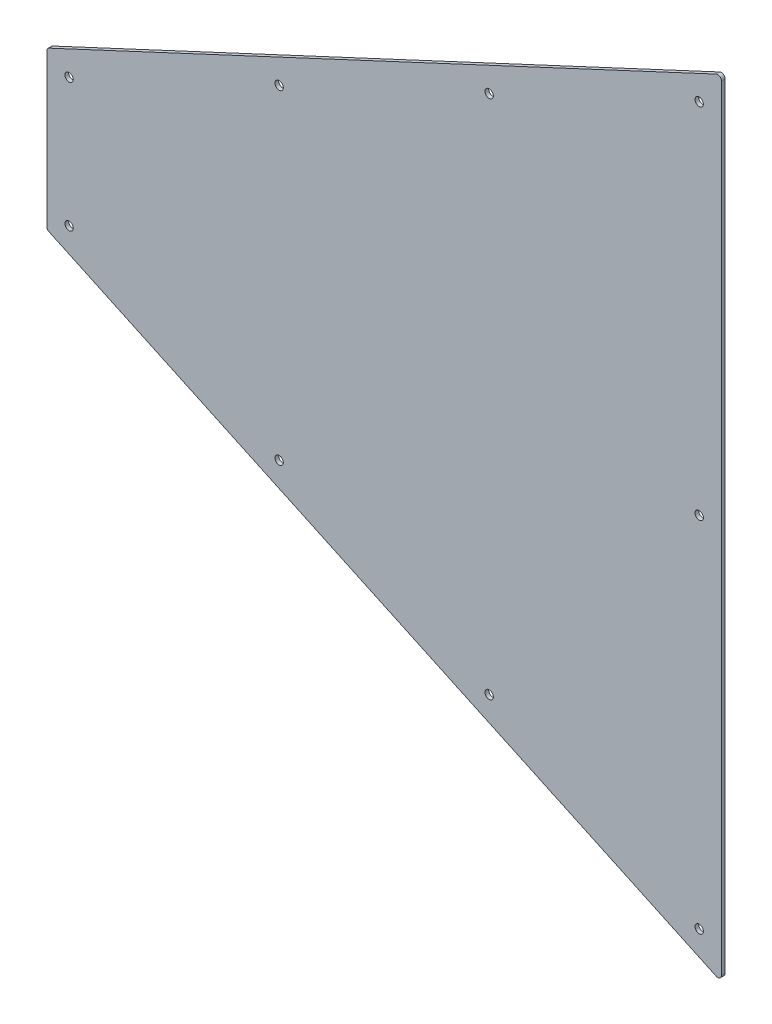
ISO-10303-21;
HEADER;
FILE_DESCRIPTION(('STEP AP214'),'2;1');
FILE_NAME('part.step','',(''),(''),'','','');
FILE_SCHEMA(('AUTOMOTIVE_DESIGN { 1 0 10303 214 1 1 1 1 }'));
ENDSEC;
DATA;
#1=APPLICATION_CONTEXT('core data for automotive mechanical design processes');
#2=APPLICATION_PROTOCOL_DEFINITION('international standard','automotive_design',2000,#1);
#3=PRODUCT_CONTEXT('',#1,'mechanical');
#4=PRODUCT('Part','Part','',(#3));
#5=PRODUCT_RELATED_PRODUCT_CATEGORY('part','',(#4));
#6=PRODUCT_DEFINITION_FORMATION('','',#4);
#7=PRODUCT_DEFINITION_CONTEXT('part definition',#1,'design');
#8=PRODUCT_DEFINITION('design','',#6,#7);
#9=PRODUCT_DEFINITION_SHAPE('','',#8);
#10=(LENGTH_UNIT() NAMED_UNIT(*) SI_UNIT(.MILLI.,.METRE.));
#11=(NAMED_UNIT(*) PLANE_ANGLE_UNIT() SI_UNIT($,.RADIAN.));
#12=(NAMED_UNIT(*) SI_UNIT($,.STERADIAN.) SOLID_ANGLE_UNIT());
#13=UNCERTAINTY_MEASURE_WITH_UNIT(LENGTH_MEASURE(1.E-05),#10,'distance_accuracy_value','');
#14=(GEOMETRIC_REPRESENTATION_CONTEXT(3) GLOBAL_UNCERTAINTY_ASSIGNED_CONTEXT((#13)) GLOBAL_UNIT_ASSIGNED_CONTEXT((#10,
#11,#12)) REPRESENTATION_CONTEXT('',''));
#15=CARTESIAN_POINT('',(0.,0.,0.));
#16=DIRECTION('',(0.,0.,1.));
#17=DIRECTION('',(1.,0.,0.));
#18=AXIS2_PLACEMENT_3D('',#15,#16,#17);
#19=CARTESIAN_POINT('',(5.00000000000013,-41.1078928580376,-2.));
#20=DIRECTION('',(0.,0.,1.));
#21=DIRECTION('',(1.,0.,0.));
#22=AXIS2_PLACEMENT_3D('',#19,#20,#21);
#23=CYLINDRICAL_SURFACE('',#22,1.99999999999999);
#24=CARTESIAN_POINT('',(5.00000000000013,-41.1078928580376,0.));
#25=DIRECTION('',(0.,0.,1.));
#26=DIRECTION('',(1.,0.,0.));
#27=AXIS2_PLACEMENT_3D('',#24,#25,#26);
#28=CIRCLE('',#27,1.99999999999999);
#29=CARTESIAN_POINT('',(4.15476347651876,-42.9205084321108,0.));
#30=VERTEX_POINT('',#29);
#31=CARTESIAN_POINT('',(3.00000000000013,-41.1078928580376,0.));
#32=VERTEX_POINT('',#31);
#33=EDGE_CURVE('E160',#30,#32,#28,.F.);
#34=ORIENTED_EDGE('',*,*,#33,.T.);
#35=DIRECTION('',(0.,0.,1.));
#36=VECTOR('',#35,1.);
#37=CARTESIAN_POINT('',(3.00000000000013,-41.1078928580376,-2.));
#38=LINE('',#37,#36);
#39=CARTESIAN_POINT('',(3.00000000000013,-41.1078928580376,-2.));
#40=VERTEX_POINT('',#39);
#41=EDGE_CURVE('E11',#40,#32,#38,.T.);
#42=ORIENTED_EDGE('',*,*,#41,.F.);
#43=CARTESIAN_POINT('',(5.00000000000013,-41.1078928580376,-2.));
#44=DIRECTION('',(0.,0.,1.));
#45=DIRECTION('',(1.,0.,0.));
#46=AXIS2_PLACEMENT_3D('',#43,#44,#45);
#47=CIRCLE('',#46,1.99999999999999);
#48=CARTESIAN_POINT('',(4.15476347651876,-42.9205084321108,-2.));
#49=VERTEX_POINT('',#48);
#50=EDGE_CURVE('E207',#49,#40,#47,.F.);
#51=ORIENTED_EDGE('',*,*,#50,.F.);
#52=DIRECTION('',(0.,0.,1.));
#53=VECTOR('',#52,1.);
#54=CARTESIAN_POINT('',(4.15476347651876,-42.9205084321108,-2.));
#55=LINE('',#54,#53);
#56=EDGE_CURVE('E40',#49,#30,#55,.T.);
#57=ORIENTED_EDGE('',*,*,#56,.T.);
#58=EDGE_LOOP('',(#34,#42,#51,#57));
#59=FACE_BOUND('',#58,.T.);
#60=ADVANCED_FACE('F36',(#59),#23,.T.);
#61=CARTESIAN_POINT('',(3.00000000000014,0.,-2.));
#62=DIRECTION('',(1.,0.,0.));
#63=DIRECTION('',(0.,1.,0.));
#64=AXIS2_PLACEMENT_3D('',#61,#62,#63);
#65=PLANE('',#64);
#66=DIRECTION('',(0.,1.,0.));
#67=VECTOR('',#66,1.);
#68=CARTESIAN_POINT('',(3.00000000000014,0.,0.));
#69=LINE('',#68,#67);
#70=CARTESIAN_POINT('',(3.00000000000015,41.1078928580375,0.));
#71=VERTEX_POINT('',#70);
#72=EDGE_CURVE('E80',#32,#71,#69,.T.);
#73=ORIENTED_EDGE('',*,*,#72,.T.);
#74=DIRECTION('',(0.,0.,1.));
#75=VECTOR('',#74,1.);
#76=CARTESIAN_POINT('',(3.00000000000015,41.1078928580375,-2.));
#77=LINE('',#76,#75);
#78=CARTESIAN_POINT('',(3.00000000000015,41.1078928580375,-2.));
#79=VERTEX_POINT('',#78);
#80=EDGE_CURVE('E46',#79,#71,#77,.T.);
#81=ORIENTED_EDGE('',*,*,#80,.F.);
#82=DIRECTION('',(0.,1.,0.));
#83=VECTOR('',#82,1.);
#84=CARTESIAN_POINT('',(3.00000000000014,0.,-2.));
#85=LINE('',#84,#83);
#86=EDGE_CURVE('E54',#40,#79,#85,.T.);
#87=ORIENTED_EDGE('',*,*,#86,.F.);
#88=ORIENTED_EDGE('',*,*,#41,.T.);
#89=EDGE_LOOP('',(#73,#81,#87,#88));
#90=FACE_BOUND('',#89,.T.);
#91=ADVANCED_FACE('F230',(#90),#65,.F.);
#92=CARTESIAN_POINT('',(5.00000000000015,41.1078928580375,-2.));
#93=DIRECTION('',(0.,0.,1.));
#94=DIRECTION('',(1.,0.,0.));
#95=AXIS2_PLACEMENT_3D('',#92,#93,#94);
#96=CYLINDRICAL_SURFACE('',#95,2.);
#97=CARTESIAN_POINT('',(5.00000000000015,41.1078928580375,0.));
#98=DIRECTION('',(0.,0.,1.));
#99=DIRECTION('',(1.,0.,0.));
#100=AXIS2_PLACEMENT_3D('',#97,#98,#99);
#101=CIRCLE('',#100,2.);
#102=CARTESIAN_POINT('',(4.15476347651876,42.9205084321108,0.));
#103=VERTEX_POINT('',#102);
#104=EDGE_CURVE('E118',#71,#103,#101,.F.);
#105=ORIENTED_EDGE('',*,*,#104,.T.);
#106=DIRECTION('',(0.,0.,1.));
#107=VECTOR('',#106,1.);
#108=CARTESIAN_POINT('',(4.15476347651876,42.9205084321108,-2.));
#109=LINE('',#108,#107);
#110=CARTESIAN_POINT('',(4.15476347651876,42.9205084321108,-2.));
#111=VERTEX_POINT('',#110);
#112=EDGE_CURVE('E116',#111,#103,#109,.T.);
#113=ORIENTED_EDGE('',*,*,#112,.F.);
#114=CARTESIAN_POINT('',(5.00000000000015,41.1078928580375,-2.));
#115=DIRECTION('',(0.,0.,1.));
#116=DIRECTION('',(1.,0.,0.));
#117=AXIS2_PLACEMENT_3D('',#114,#115,#116);
#118=CIRCLE('',#117,2.);
#119=EDGE_CURVE('E106',#79,#111,#118,.F.);
#120=ORIENTED_EDGE('',*,*,#119,.F.);
#121=ORIENTED_EDGE('',*,*,#80,.T.);
#122=EDGE_LOOP('',(#105,#113,#120,#121));
#123=FACE_BOUND('',#122,.T.);
#124=ADVANCED_FACE('F117',(#123),#96,.T.);
#125=CARTESIAN_POINT('',(-15.6974419938127,33.6632729900287,-2.));
#126=DIRECTION('',(0.422618261740699,-0.90630778703665,0.));
#127=DIRECTION('',(0.90630778703665,0.422618261740699,0.));
#128=AXIS2_PLACEMENT_3D('',#125,#126,#127);
#129=PLANE('',#128);
#130=DIRECTION('',(0.90630778703665,0.422618261740699,0.));
#131=VECTOR('',#130,1.);
#132=CARTESIAN_POINT('',(-15.6974419938127,33.6632729900287,0.));
#133=LINE('',#132,#131);
#134=CARTESIAN_POINT('',(364.226714184927,210.824816534251,0.));
#135=VERTEX_POINT('',#134);
#136=EDGE_CURVE('E171',#103,#135,#133,.T.);
#137=ORIENTED_EDGE('',*,*,#136,.T.);
#138=DIRECTION('',(0.,0.,1.));
#139=VECTOR('',#138,1.);
#140=CARTESIAN_POINT('',(364.226714184927,210.824816534251,-2.));
#141=LINE('',#140,#139);
#142=CARTESIAN_POINT('',(364.226714184927,210.824816534251,-2.));
#143=VERTEX_POINT('',#142);
#144=EDGE_CURVE('E121',#143,#135,#141,.T.);
#145=ORIENTED_EDGE('',*,*,#144,.F.);
#146=DIRECTION('',(0.90630778703665,0.422618261740699,0.));
#147=VECTOR('',#146,1.);
#148=CARTESIAN_POINT('',(-15.6974419938127,33.6632729900287,-2.));
#149=LINE('',#148,#147);
#150=EDGE_CURVE('E111',#111,#143,#149,.T.);
#151=ORIENTED_EDGE('',*,*,#150,.F.);
#152=ORIENTED_EDGE('',*,*,#112,.T.);
#153=EDGE_LOOP('',(#137,#145,#151,#152));
#154=FACE_BOUND('',#153,.T.);
#155=ADVANCED_FACE('F123',(#154),#129,.F.);
#156=CARTESIAN_POINT('',(365.071950708408,209.012200960177,-2.));
#157=DIRECTION('',(0.,0.,1.));
#158=DIRECTION('',(1.,0.,0.));
#159=AXIS2_PLACEMENT_3D('',#156,#157,#158);
#160=CYLINDRICAL_SURFACE('',#159,2.00000000000002);
#161=CARTESIAN_POINT('',(365.071950708408,209.012200960177,0.));
#162=DIRECTION('',(0.,0.,1.));
#163=DIRECTION('',(1.,0.,0.));
#164=AXIS2_PLACEMENT_3D('',#161,#162,#163);
#165=CIRCLE('',#164,2.00000000000002);
#166=CARTESIAN_POINT('',(367.071950708408,209.012200960177,0.));
#167=VERTEX_POINT('',#166);
#168=EDGE_CURVE('E169',#135,#167,#165,.F.);
#169=ORIENTED_EDGE('',*,*,#168,.T.);
#170=DIRECTION('',(0.,0.,1.));
#171=VECTOR('',#170,1.);
#172=CARTESIAN_POINT('',(367.071950708408,209.012200960177,-2.));
#173=LINE('',#172,#171);
#174=CARTESIAN_POINT('',(367.071950708408,209.012200960177,-2.));
#175=VERTEX_POINT('',#174);
#176=EDGE_CURVE('E193',#175,#167,#173,.T.);
#177=ORIENTED_EDGE('',*,*,#176,.F.);
#178=CARTESIAN_POINT('',(365.071950708408,209.012200960177,-2.));
#179=DIRECTION('',(0.,0.,1.));
#180=DIRECTION('',(1.,0.,0.));
#181=AXIS2_PLACEMENT_3D('',#178,#179,#180);
#182=CIRCLE('',#181,2.00000000000002);
#183=EDGE_CURVE('E126',#143,#175,#182,.F.);
#184=ORIENTED_EDGE('',*,*,#183,.F.);
#185=ORIENTED_EDGE('',*,*,#144,.T.);
#186=EDGE_LOOP('',(#169,#177,#184,#185));
#187=FACE_BOUND('',#186,.T.);
#188=ADVANCED_FACE('F286',(#187),#160,.T.);
#189=CARTESIAN_POINT('',(367.071950708408,-1.46234907399565E-13,-2.));
#190=DIRECTION('',(-1.,0.,0.));
#191=DIRECTION('',(0.,-1.,0.));
#192=AXIS2_PLACEMENT_3D('',#189,#190,#191);
#193=PLANE('',#192);
#194=DIRECTION('',(0.,-1.,0.));
#195=VECTOR('',#194,1.);
#196=CARTESIAN_POINT('',(367.071950708408,-1.46234907399565E-13,0.));
#197=LINE('',#196,#195);
#198=CARTESIAN_POINT('',(367.071950708408,-209.012200960178,0.));
#199=VERTEX_POINT('',#198);
#200=EDGE_CURVE('E167',#167,#199,#197,.T.);
#201=ORIENTED_EDGE('',*,*,#200,.T.);
#202=DIRECTION('',(0.,0.,1.));
#203=VECTOR('',#202,1.);
#204=CARTESIAN_POINT('',(367.071950708408,-209.012200960178,-2.));
#205=LINE('',#204,#203);
#206=CARTESIAN_POINT('',(367.071950708408,-209.012200960178,-2.));
#207=VERTEX_POINT('',#206);
#208=EDGE_CURVE('E196',#207,#199,#205,.T.);
#209=ORIENTED_EDGE('',*,*,#208,.F.);
#210=DIRECTION('',(0.,-1.,0.));
#211=VECTOR('',#210,1.);
#212=CARTESIAN_POINT('',(367.071950708408,-1.46234907399565E-13,-2.));
#213=LINE('',#212,#211);
#214=EDGE_CURVE('E128',#175,#207,#213,.T.);
#215=ORIENTED_EDGE('',*,*,#214,.F.);
#216=ORIENTED_EDGE('',*,*,#176,.T.);
#217=EDGE_LOOP('',(#201,#209,#215,#216));
#218=FACE_BOUND('',#217,.T.);
#219=ADVANCED_FACE('F289',(#218),#193,.F.);
#220=CARTESIAN_POINT('',(365.071950708408,-209.012200960178,-2.));
#221=DIRECTION('',(0.,0.,1.));
#222=DIRECTION('',(1.,0.,0.));
#223=AXIS2_PLACEMENT_3D('',#220,#221,#222);
#224=CYLINDRICAL_SURFACE('',#223,2.);
#225=CARTESIAN_POINT('',(365.071950708408,-209.012200960178,0.));
#226=DIRECTION('',(0.,0.,1.));
#227=DIRECTION('',(1.,0.,0.));
#228=AXIS2_PLACEMENT_3D('',#225,#226,#227);
#229=CIRCLE('',#228,2.);
#230=CARTESIAN_POINT('',(364.226714184927,-210.824816534251,0.));
#231=VERTEX_POINT('',#230);
#232=EDGE_CURVE('E165',#199,#231,#229,.F.);
#233=ORIENTED_EDGE('',*,*,#232,.T.);
#234=DIRECTION('',(0.,0.,1.));
#235=VECTOR('',#234,1.);
#236=CARTESIAN_POINT('',(364.226714184927,-210.824816534251,-2.));
#237=LINE('',#236,#235);
#238=CARTESIAN_POINT('',(364.226714184927,-210.824816534251,-2.));
#239=VERTEX_POINT('',#238);
#240=EDGE_CURVE('E198',#239,#231,#237,.T.);
#241=ORIENTED_EDGE('',*,*,#240,.F.);
#242=CARTESIAN_POINT('',(365.071950708408,-209.012200960178,-2.));
#243=DIRECTION('',(0.,0.,1.));
#244=DIRECTION('',(1.,0.,0.));
#245=AXIS2_PLACEMENT_3D('',#242,#243,#244);
#246=CIRCLE('',#245,2.);
#247=EDGE_CURVE('E299',#207,#239,#246,.F.);
#248=ORIENTED_EDGE('',*,*,#247,.F.);
#249=ORIENTED_EDGE('',*,*,#208,.T.);
#250=EDGE_LOOP('',(#233,#241,#248,#249));
#251=FACE_BOUND('',#250,.T.);
#252=ADVANCED_FACE('F274',(#251),#224,.T.);
#253=CARTESIAN_POINT('',(128.357316902803,87.5965752296426,-2.));
#254=DIRECTION('',(0.,0.,1.));
#255=DIRECTION('',(1.,0.,0.));
#256=AXIS2_PLACEMENT_3D('',#253,#254,#255);
#257=CYLINDRICAL_SURFACE('',#256,2.25000000000001);
#258=CARTESIAN_POINT('',(128.357316902803,87.5965752296426,-2.));
#259=DIRECTION('',(0.,0.,1.));
#260=DIRECTION('',(1.,0.,0.));
#261=AXIS2_PLACEMENT_3D('',#258,#259,#260);
#262=CIRCLE('',#261,2.25000000000001);
#263=CARTESIAN_POINT('',(130.607316902803,87.5965752296426,-2.));
#264=VERTEX_POINT('',#263);
#265=EDGE_CURVE('E142',#264,#264,#262,.F.);
#266=ORIENTED_EDGE('',*,*,#265,.T.);
#267=EDGE_LOOP('',(#266));
#268=FACE_BOUND('',#267,.T.);
#269=CARTESIAN_POINT('',(128.357316902803,87.5965752296426,0.));
#270=DIRECTION('',(0.,0.,1.));
#271=DIRECTION('',(1.,0.,0.));
#272=AXIS2_PLACEMENT_3D('',#269,#270,#271);
#273=CIRCLE('',#272,2.25000000000001);
#274=CARTESIAN_POINT('',(130.607316902803,87.5965752296426,0.));
#275=VERTEX_POINT('',#274);
#276=EDGE_CURVE('E184',#275,#275,#273,.F.);
#277=ORIENTED_EDGE('',*,*,#276,.F.);
#278=EDGE_LOOP('',(#277));
#279=FACE_BOUND('',#278,.T.);
#280=ADVANCED_FACE('F270',(#268,#279),#257,.F.);
#281=CARTESIAN_POINT('',(15.0000000000001,-34.7371902499626,-2.));
#282=DIRECTION('',(0.,0.,1.));
#283=DIRECTION('',(1.,0.,0.));
#284=AXIS2_PLACEMENT_3D('',#281,#282,#283);
#285=CYLINDRICAL_SURFACE('',#284,2.24999999999999);
#286=CARTESIAN_POINT('',(15.0000000000001,-34.7371902499626,-2.));
#287=DIRECTION('',(0.,0.,1.));
#288=DIRECTION('',(1.,0.,0.));
#289=AXIS2_PLACEMENT_3D('',#286,#287,#288);
#290=CIRCLE('',#289,2.24999999999999);
#291=CARTESIAN_POINT('',(17.2500000000001,-34.7371902499626,-2.));
#292=VERTEX_POINT('',#291);
#293=EDGE_CURVE('E139',#292,#292,#290,.F.);
#294=ORIENTED_EDGE('',*,*,#293,.T.);
#295=EDGE_LOOP('',(#294));
#296=FACE_BOUND('',#295,.T.);
#297=CARTESIAN_POINT('',(15.0000000000001,-34.7371902499626,0.));
#298=DIRECTION('',(0.,0.,1.));
#299=DIRECTION('',(1.,0.,0.));
#300=AXIS2_PLACEMENT_3D('',#297,#298,#299);
#301=CIRCLE('',#300,2.24999999999999);
#302=CARTESIAN_POINT('',(17.2500000000001,-34.7371902499626,0.));
#303=VERTEX_POINT('',#302);
#304=EDGE_CURVE('E181',#303,#303,#301,.F.);
#305=ORIENTED_EDGE('',*,*,#304,.F.);
#306=EDGE_LOOP('',(#305));
#307=FACE_BOUND('',#306,.T.);
#308=ADVANCED_FACE('F273',(#296,#307),#285,.F.);
#309=CARTESIAN_POINT('',(241.714633805606,-140.455960209323,-2.));
#310=DIRECTION('',(0.,0.,1.));
#311=DIRECTION('',(1.,0.,0.));
#312=AXIS2_PLACEMENT_3D('',#309,#310,#311);
#313=CYLINDRICAL_SURFACE('',#312,2.25000000000001);
#314=CARTESIAN_POINT('',(241.714633805606,-140.455960209323,-2.));
#315=DIRECTION('',(0.,0.,1.));
#316=DIRECTION('',(1.,0.,0.));
#317=AXIS2_PLACEMENT_3D('',#314,#315,#316);
#318=CIRCLE('',#317,2.25000000000001);
#319=CARTESIAN_POINT('',(243.964633805606,-140.455960209323,-2.));
#320=VERTEX_POINT('',#319);
#321=EDGE_CURVE('E136',#320,#320,#318,.F.);
#322=ORIENTED_EDGE('',*,*,#321,.T.);
#323=EDGE_LOOP('',(#322));
#324=FACE_BOUND('',#323,.T.);
#325=CARTESIAN_POINT('',(241.714633805606,-140.455960209323,0.));
#326=DIRECTION('',(0.,0.,1.));
#327=DIRECTION('',(1.,0.,0.));
#328=AXIS2_PLACEMENT_3D('',#325,#326,#327);
#329=CIRCLE('',#328,2.25000000000001);
#330=CARTESIAN_POINT('',(243.964633805606,-140.455960209323,0.));
#331=VERTEX_POINT('',#330);
#332=EDGE_CURVE('E178',#331,#331,#329,.F.);
#333=ORIENTED_EDGE('',*,*,#332,.F.);
#334=EDGE_LOOP('',(#333));
#335=FACE_BOUND('',#334,.T.);
#336=ADVANCED_FACE('F224',(#324,#335),#313,.F.);
#337=CARTESIAN_POINT('',(355.071950708408,-1.46617901741787E-13,-2.));
#338=DIRECTION('',(0.,0.,1.));
#339=DIRECTION('',(1.,0.,0.));
#340=AXIS2_PLACEMENT_3D('',#337,#338,#339);
#341=CYLINDRICAL_SURFACE('',#340,2.24999999999995);
#342=CARTESIAN_POINT('',(355.071950708408,-1.46617901741787E-13,-2.));
#343=DIRECTION('',(0.,0.,1.));
#344=DIRECTION('',(1.,0.,0.));
#345=AXIS2_PLACEMENT_3D('',#342,#343,#344);
#346=CIRCLE('',#345,2.24999999999995);
#347=CARTESIAN_POINT('',(357.321950708408,-1.46617901741787E-13,-2.));
#348=VERTEX_POINT('',#347);
#349=EDGE_CURVE('E133',#348,#348,#346,.F.);
#350=ORIENTED_EDGE('',*,*,#349,.T.);
#351=EDGE_LOOP('',(#350));
#352=FACE_BOUND('',#351,.T.);
#353=CARTESIAN_POINT('',(355.071950708408,-1.46617901741787E-13,0.));
#354=DIRECTION('',(0.,0.,1.));
#355=DIRECTION('',(1.,0.,0.));
#356=AXIS2_PLACEMENT_3D('',#353,#354,#355);
#357=CIRCLE('',#356,2.24999999999995);
#358=CARTESIAN_POINT('',(357.321950708408,-1.46617901741787E-13,0.));
#359=VERTEX_POINT('',#358);
#360=EDGE_CURVE('E175',#359,#359,#357,.F.);
#361=ORIENTED_EDGE('',*,*,#360,.F.);
#362=EDGE_LOOP('',(#361));
#363=FACE_BOUND('',#362,.T.);
#364=ADVANCED_FACE('F215',(#352,#363),#341,.F.);
#365=CARTESIAN_POINT('',(-15.6974419938127,-33.6632729900287,-2.));
#366=DIRECTION('',(0.4226182617407,0.90630778703665,0.));
#367=DIRECTION('',(-0.90630778703665,0.4226182617407,0.));
#368=AXIS2_PLACEMENT_3D('',#365,#366,#367);
#369=PLANE('',#368);
#370=DIRECTION('',(-0.90630778703665,0.4226182617407,0.));
#371=VECTOR('',#370,1.);
#372=CARTESIAN_POINT('',(-15.6974419938127,-33.6632729900287,0.));
#373=LINE('',#372,#371);
#374=EDGE_CURVE('E163',#231,#30,#373,.T.);
#375=ORIENTED_EDGE('',*,*,#374,.T.);
#376=ORIENTED_EDGE('',*,*,#56,.F.);
#377=DIRECTION('',(-0.90630778703665,0.4226182617407,0.));
#378=VECTOR('',#377,1.);
#379=CARTESIAN_POINT('',(-15.6974419938127,-33.6632729900287,-2.));
#380=LINE('',#379,#378);
#381=EDGE_CURVE('E92',#239,#49,#380,.T.);
#382=ORIENTED_EDGE('',*,*,#381,.F.);
#383=ORIENTED_EDGE('',*,*,#240,.T.);
#384=EDGE_LOOP('',(#375,#376,#382,#383));
#385=FACE_BOUND('',#384,.T.);
#386=ADVANCED_FACE('F212',(#385),#369,.F.);
#387=CARTESIAN_POINT('',(355.071950708408,-193.315345189003,-2.));
#388=DIRECTION('',(0.,0.,1.));
#389=DIRECTION('',(1.,0.,0.));
#390=AXIS2_PLACEMENT_3D('',#387,#388,#389);
#391=CYLINDRICAL_SURFACE('',#390,2.24999999999996);
#392=CARTESIAN_POINT('',(355.071950708408,-193.315345189003,-2.));
#393=DIRECTION('',(0.,0.,1.));
#394=DIRECTION('',(1.,0.,0.));
#395=AXIS2_PLACEMENT_3D('',#392,#393,#394);
#396=CIRCLE('',#395,2.24999999999996);
#397=CARTESIAN_POINT('',(357.321950708408,-193.315345189003,-2.));
#398=VERTEX_POINT('',#397);
#399=EDGE_CURVE('E307',#398,#398,#396,.F.);
#400=ORIENTED_EDGE('',*,*,#399,.T.);
#401=EDGE_LOOP('',(#400));
#402=FACE_BOUND('',#401,.T.);
#403=CARTESIAN_POINT('',(355.071950708408,-193.315345189003,0.));
#404=DIRECTION('',(0.,0.,1.));
#405=DIRECTION('',(1.,0.,0.));
#406=AXIS2_PLACEMENT_3D('',#403,#404,#405);
#407=CIRCLE('',#406,2.24999999999996);
#408=CARTESIAN_POINT('',(357.321950708408,-193.315345189003,0.));
#409=VERTEX_POINT('',#408);
#410=EDGE_CURVE('E157',#409,#409,#407,.F.);
#411=ORIENTED_EDGE('',*,*,#410,.F.);
#412=EDGE_LOOP('',(#411));
#413=FACE_BOUND('',#412,.T.);
#414=ADVANCED_FACE('F214',(#402,#413),#391,.F.);
#415=CARTESIAN_POINT('',(128.357316902803,-87.5965752296427,-2.));
#416=DIRECTION('',(0.,0.,1.));
#417=DIRECTION('',(1.,0.,0.));
#418=AXIS2_PLACEMENT_3D('',#415,#416,#417);
#419=CYLINDRICAL_SURFACE('',#418,2.25000000000001);
#420=CARTESIAN_POINT('',(128.357316902803,-87.5965752296427,-2.));
#421=DIRECTION('',(0.,0.,1.));
#422=DIRECTION('',(1.,0.,0.));
#423=AXIS2_PLACEMENT_3D('',#420,#421,#422);
#424=CIRCLE('',#423,2.25000000000001);
#425=CARTESIAN_POINT('',(130.607316902803,-87.5965752296427,-2.));
#426=VERTEX_POINT('',#425);
#427=EDGE_CURVE('E310',#426,#426,#424,.F.);
#428=ORIENTED_EDGE('',*,*,#427,.T.);
#429=EDGE_LOOP('',(#428));
#430=FACE_BOUND('',#429,.T.);
#431=CARTESIAN_POINT('',(128.357316902803,-87.5965752296427,0.));
#432=DIRECTION('',(0.,0.,1.));
#433=DIRECTION('',(1.,0.,0.));
#434=AXIS2_PLACEMENT_3D('',#431,#432,#433);
#435=CIRCLE('',#434,2.25000000000001);
#436=CARTESIAN_POINT('',(130.607316902803,-87.5965752296427,0.));
#437=VERTEX_POINT('',#436);
#438=EDGE_CURVE('E154',#437,#437,#435,.F.);
#439=ORIENTED_EDGE('',*,*,#438,.F.);
#440=EDGE_LOOP('',(#439));
#441=FACE_BOUND('',#440,.T.);
#442=ADVANCED_FACE('F221',(#430,#441),#419,.F.);
#443=CARTESIAN_POINT('',(15.0000000000002,34.7371902499626,-2.));
#444=DIRECTION('',(0.,0.,1.));
#445=DIRECTION('',(1.,0.,0.));
#446=AXIS2_PLACEMENT_3D('',#443,#444,#445);
#447=CYLINDRICAL_SURFACE('',#446,2.24999999999999);
#448=CARTESIAN_POINT('',(15.0000000000002,34.7371902499626,-2.));
#449=DIRECTION('',(0.,0.,1.));
#450=DIRECTION('',(1.,0.,0.));
#451=AXIS2_PLACEMENT_3D('',#448,#449,#450);
#452=CIRCLE('',#451,2.24999999999999);
#453=CARTESIAN_POINT('',(17.2500000000002,34.7371902499626,-2.));
#454=VERTEX_POINT('',#453);
#455=EDGE_CURVE('E249',#454,#454,#452,.F.);
#456=ORIENTED_EDGE('',*,*,#455,.T.);
#457=EDGE_LOOP('',(#456));
#458=FACE_BOUND('',#457,.T.);
#459=CARTESIAN_POINT('',(15.0000000000002,34.7371902499626,0.));
#460=DIRECTION('',(0.,0.,1.));
#461=DIRECTION('',(1.,0.,0.));
#462=AXIS2_PLACEMENT_3D('',#459,#460,#461);
#463=CIRCLE('',#462,2.24999999999999);
#464=CARTESIAN_POINT('',(17.2500000000002,34.7371902499626,0.));
#465=VERTEX_POINT('',#464);
#466=EDGE_CURVE('E151',#465,#465,#463,.F.);
#467=ORIENTED_EDGE('',*,*,#466,.F.);
#468=EDGE_LOOP('',(#467));
#469=FACE_BOUND('',#468,.T.);
#470=ADVANCED_FACE('F237',(#458,#469),#447,.F.);
#471=CARTESIAN_POINT('',(241.714633805606,140.455960209323,-2.));
#472=DIRECTION('',(0.,0.,1.));
#473=DIRECTION('',(1.,0.,0.));
#474=AXIS2_PLACEMENT_3D('',#471,#472,#473);
#475=CYLINDRICAL_SURFACE('',#474,2.25000000000001);
#476=CARTESIAN_POINT('',(241.714633805606,140.455960209323,-2.));
#477=DIRECTION('',(0.,0.,1.));
#478=DIRECTION('',(1.,0.,0.));
#479=AXIS2_PLACEMENT_3D('',#476,#477,#478);
#480=CIRCLE('',#479,2.25000000000001);
#481=CARTESIAN_POINT('',(243.964633805606,140.455960209323,-2.));
#482=VERTEX_POINT('',#481);
#483=EDGE_CURVE('E189',#482,#482,#480,.F.);
#484=ORIENTED_EDGE('',*,*,#483,.T.);
#485=EDGE_LOOP('',(#484));
#486=FACE_BOUND('',#485,.T.);
#487=CARTESIAN_POINT('',(241.714633805606,140.455960209323,0.));
#488=DIRECTION('',(0.,0.,1.));
#489=DIRECTION('',(1.,0.,0.));
#490=AXIS2_PLACEMENT_3D('',#487,#488,#489);
#491=CIRCLE('',#490,2.25000000000001);
#492=CARTESIAN_POINT('',(243.964633805606,140.455960209323,0.));
#493=VERTEX_POINT('',#492);
#494=EDGE_CURVE('E148',#493,#493,#491,.F.);
#495=ORIENTED_EDGE('',*,*,#494,.F.);
#496=EDGE_LOOP('',(#495));
#497=FACE_BOUND('',#496,.T.);
#498=ADVANCED_FACE('F38',(#486,#497),#475,.F.);
#499=CARTESIAN_POINT('',(355.071950708408,193.315345189002,-2.));
#500=DIRECTION('',(0.,0.,1.));
#501=DIRECTION('',(1.,0.,0.));
#502=AXIS2_PLACEMENT_3D('',#499,#500,#501);
#503=CYLINDRICAL_SURFACE('',#502,2.24999999999996);
#504=CARTESIAN_POINT('',(355.071950708408,193.315345189002,-2.));
#505=DIRECTION('',(0.,0.,1.));
#506=DIRECTION('',(1.,0.,0.));
#507=AXIS2_PLACEMENT_3D('',#504,#505,#506);
#508=CIRCLE('',#507,2.24999999999996);
#509=CARTESIAN_POINT('',(357.321950708408,193.315345189002,-2.));
#510=VERTEX_POINT('',#509);
#511=EDGE_CURVE('E145',#510,#510,#508,.F.);
#512=ORIENTED_EDGE('',*,*,#511,.T.);
#513=EDGE_LOOP('',(#512));
#514=FACE_BOUND('',#513,.T.);
#515=CARTESIAN_POINT('',(355.071950708408,193.315345189002,0.));
#516=DIRECTION('',(0.,0.,1.));
#517=DIRECTION('',(1.,0.,0.));
#518=AXIS2_PLACEMENT_3D('',#515,#516,#517);
#519=CIRCLE('',#518,2.24999999999996);
#520=CARTESIAN_POINT('',(357.321950708408,193.315345189002,0.));
#521=VERTEX_POINT('',#520);
#522=EDGE_CURVE('E187',#521,#521,#519,.F.);
#523=ORIENTED_EDGE('',*,*,#522,.F.);
#524=EDGE_LOOP('',(#523));
#525=FACE_BOUND('',#524,.T.);
#526=ADVANCED_FACE('F244',(#514,#525),#503,.F.);
#527=CARTESIAN_POINT('',(0.,0.,-2.));
#528=DIRECTION('',(0.,0.,1.));
#529=DIRECTION('',(1.,0.,0.));
#530=AXIS2_PLACEMENT_3D('',#527,#528,#529);
#531=PLANE('',#530);
#532=ORIENTED_EDGE('',*,*,#483,.F.);
#533=EDGE_LOOP('',(#532));
#534=FACE_BOUND('',#533,.T.);
#535=ORIENTED_EDGE('',*,*,#455,.F.);
#536=EDGE_LOOP('',(#535));
#537=FACE_BOUND('',#536,.T.);
#538=ORIENTED_EDGE('',*,*,#427,.F.);
#539=EDGE_LOOP('',(#538));
#540=FACE_BOUND('',#539,.T.);
#541=ORIENTED_EDGE('',*,*,#399,.F.);
#542=EDGE_LOOP('',(#541));
#543=FACE_BOUND('',#542,.T.);
#544=ORIENTED_EDGE('',*,*,#50,.T.);
#545=ORIENTED_EDGE('',*,*,#86,.T.);
#546=ORIENTED_EDGE('',*,*,#119,.T.);
#547=ORIENTED_EDGE('',*,*,#150,.T.);
#548=ORIENTED_EDGE('',*,*,#183,.T.);
#549=ORIENTED_EDGE('',*,*,#214,.T.);
#550=ORIENTED_EDGE('',*,*,#247,.T.);
#551=ORIENTED_EDGE('',*,*,#381,.T.);
#552=EDGE_LOOP('',(#544,#545,#546,#547,#548,#549,#550,#551));
#553=FACE_BOUND('',#552,.T.);
#554=ORIENTED_EDGE('',*,*,#349,.F.);
#555=EDGE_LOOP('',(#554));
#556=FACE_BOUND('',#555,.T.);
#557=ORIENTED_EDGE('',*,*,#321,.F.);
#558=EDGE_LOOP('',(#557));
#559=FACE_BOUND('',#558,.T.);
#560=ORIENTED_EDGE('',*,*,#293,.F.);
#561=EDGE_LOOP('',(#560));
#562=FACE_BOUND('',#561,.T.);
#563=ORIENTED_EDGE('',*,*,#265,.F.);
#564=EDGE_LOOP('',(#563));
#565=FACE_BOUND('',#564,.T.);
#566=ORIENTED_EDGE('',*,*,#511,.F.);
#567=EDGE_LOOP('',(#566));
#568=FACE_BOUND('',#567,.T.);
#569=ADVANCED_FACE('F108',(#534,#537,#540,#543,#553,#556,#559,#562,#565,#568),#531,.F.);
#570=CARTESIAN_POINT('',(0.,0.,0.));
#571=DIRECTION('',(0.,0.,1.));
#572=DIRECTION('',(1.,0.,0.));
#573=AXIS2_PLACEMENT_3D('',#570,#571,#572);
#574=PLANE('',#573);
#575=ORIENTED_EDGE('',*,*,#494,.T.);
#576=EDGE_LOOP('',(#575));
#577=FACE_BOUND('',#576,.T.);
#578=ORIENTED_EDGE('',*,*,#466,.T.);
#579=EDGE_LOOP('',(#578));
#580=FACE_BOUND('',#579,.T.);
#581=ORIENTED_EDGE('',*,*,#438,.T.);
#582=EDGE_LOOP('',(#581));
#583=FACE_BOUND('',#582,.T.);
#584=ORIENTED_EDGE('',*,*,#410,.T.);
#585=EDGE_LOOP('',(#584));
#586=FACE_BOUND('',#585,.T.);
#587=ORIENTED_EDGE('',*,*,#33,.F.);
#588=ORIENTED_EDGE('',*,*,#374,.F.);
#589=ORIENTED_EDGE('',*,*,#232,.F.);
#590=ORIENTED_EDGE('',*,*,#200,.F.);
#591=ORIENTED_EDGE('',*,*,#168,.F.);
#592=ORIENTED_EDGE('',*,*,#136,.F.);
#593=ORIENTED_EDGE('',*,*,#104,.F.);
#594=ORIENTED_EDGE('',*,*,#72,.F.);
#595=EDGE_LOOP('',(#587,#588,#589,#590,#591,#592,#593,#594));
#596=FACE_BOUND('',#595,.T.);
#597=ORIENTED_EDGE('',*,*,#360,.T.);
#598=EDGE_LOOP('',(#597));
#599=FACE_BOUND('',#598,.T.);
#600=ORIENTED_EDGE('',*,*,#332,.T.);
#601=EDGE_LOOP('',(#600));
#602=FACE_BOUND('',#601,.T.);
#603=ORIENTED_EDGE('',*,*,#304,.T.);
#604=EDGE_LOOP('',(#603));
#605=FACE_BOUND('',#604,.T.);
#606=ORIENTED_EDGE('',*,*,#276,.T.);
#607=EDGE_LOOP('',(#606));
#608=FACE_BOUND('',#607,.T.);
#609=ORIENTED_EDGE('',*,*,#522,.T.);
#610=EDGE_LOOP('',(#609));
#611=FACE_BOUND('',#610,.T.);
#612=ADVANCED_FACE('F208',(#577,#580,#583,#586,#596,#599,#602,#605,#608,#611),#574,.T.);
#613=CLOSED_SHELL('',(#60,#91,#124,#155,#188,#219,#252,#280,#308,#336,#364,#386,#414,#442,#470,
#498,#526,#569,#612));
#614=MANIFOLD_SOLID_BREP('B2',#613);
#615=ADVANCED_BREP_SHAPE_REPRESENTATION('',(#18,#614),#14);
#616=SHAPE_DEFINITION_REPRESENTATION(#9,#615);
ENDSEC;
END-ISO-10303-21;
